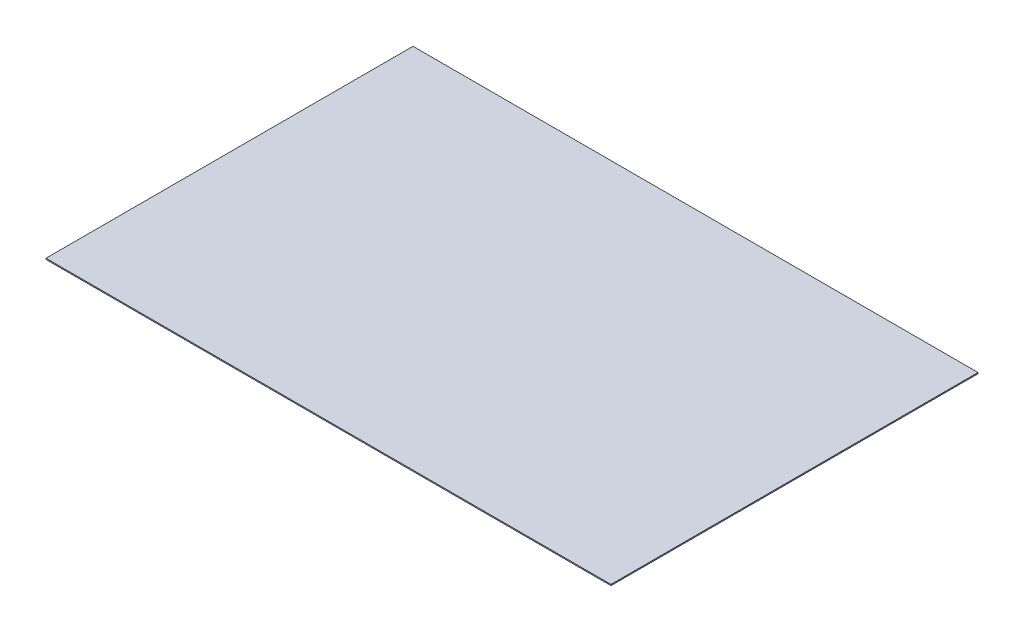
ISO-10303-21;
HEADER;
FILE_DESCRIPTION(('STEP AP214'),'2;1');
FILE_NAME('part.step','',(''),(''),'','','');
FILE_SCHEMA(('AUTOMOTIVE_DESIGN { 1 0 10303 214 1 1 1 1 }'));
ENDSEC;
DATA;
#1=APPLICATION_CONTEXT('core data for automotive mechanical design processes');
#2=APPLICATION_PROTOCOL_DEFINITION('international standard','automotive_design',2000,#1);
#3=PRODUCT_CONTEXT('',#1,'mechanical');
#4=PRODUCT('Part','Part','',(#3));
#5=PRODUCT_RELATED_PRODUCT_CATEGORY('part','',(#4));
#6=PRODUCT_DEFINITION_FORMATION('','',#4);
#7=PRODUCT_DEFINITION_CONTEXT('part definition',#1,'design');
#8=PRODUCT_DEFINITION('design','',#6,#7);
#9=PRODUCT_DEFINITION_SHAPE('','',#8);
#10=(LENGTH_UNIT() NAMED_UNIT(*) SI_UNIT(.MILLI.,.METRE.));
#11=(NAMED_UNIT(*) PLANE_ANGLE_UNIT() SI_UNIT($,.RADIAN.));
#12=(NAMED_UNIT(*) SI_UNIT($,.STERADIAN.) SOLID_ANGLE_UNIT());
#13=UNCERTAINTY_MEASURE_WITH_UNIT(LENGTH_MEASURE(1.E-05),#10,'distance_accuracy_value','');
#14=(GEOMETRIC_REPRESENTATION_CONTEXT(3) GLOBAL_UNCERTAINTY_ASSIGNED_CONTEXT((#13)) GLOBAL_UNIT_ASSIGNED_CONTEXT((#10,
#11,#12)) REPRESENTATION_CONTEXT('',''));
#15=CARTESIAN_POINT('',(0.,0.,0.));
#16=DIRECTION('',(0.,0.,1.));
#17=DIRECTION('',(1.,0.,0.));
#18=AXIS2_PLACEMENT_3D('',#15,#16,#17);
#19=CARTESIAN_POINT('',(0.,1.5875,0.));
#20=DIRECTION('',(1.,0.,0.));
#21=DIRECTION('',(0.,0.,-1.));
#22=AXIS2_PLACEMENT_3D('',#19,#20,#21);
#23=PLANE('',#22);
#24=DIRECTION('',(0.,0.,1.));
#25=VECTOR('',#24,1.);
#26=CARTESIAN_POINT('',(0.,0.,0.));
#27=LINE('',#26,#25);
#28=CARTESIAN_POINT('',(0.,0.,-526.034));
#29=VERTEX_POINT('',#28);
#30=CARTESIAN_POINT('',(0.,0.,0.));
#31=VERTEX_POINT('',#30);
#32=EDGE_CURVE('E96',#29,#31,#27,.T.);
#33=ORIENTED_EDGE('',*,*,#32,.T.);
#34=DIRECTION('',(0.,-1.,0.));
#35=VECTOR('',#34,1.);
#36=CARTESIAN_POINT('',(0.,1.5875,0.));
#37=LINE('',#36,#35);
#38=CARTESIAN_POINT('',(0.,1.5875,0.));
#39=VERTEX_POINT('',#38);
#40=EDGE_CURVE('E11',#39,#31,#37,.T.);
#41=ORIENTED_EDGE('',*,*,#40,.F.);
#42=DIRECTION('',(0.,0.,1.));
#43=VECTOR('',#42,1.);
#44=CARTESIAN_POINT('',(0.,1.5875,0.));
#45=LINE('',#44,#43);
#46=CARTESIAN_POINT('',(0.,1.5875,-526.034));
#47=VERTEX_POINT('',#46);
#48=EDGE_CURVE('E84',#47,#39,#45,.T.);
#49=ORIENTED_EDGE('',*,*,#48,.F.);
#50=DIRECTION('',(0.,-1.,0.));
#51=VECTOR('',#50,1.);
#52=CARTESIAN_POINT('',(0.,1.5875,-526.034));
#53=LINE('',#52,#51);
#54=EDGE_CURVE('E92',#47,#29,#53,.T.);
#55=ORIENTED_EDGE('',*,*,#54,.T.);
#56=EDGE_LOOP('',(#33,#41,#49,#55));
#57=FACE_BOUND('',#56,.T.);
#58=ADVANCED_FACE('F33',(#57),#23,.F.);
#59=CARTESIAN_POINT('',(0.,1.5875,0.));
#60=DIRECTION('',(0.,0.,-1.));
#61=DIRECTION('',(-1.,0.,0.));
#62=AXIS2_PLACEMENT_3D('',#59,#60,#61);
#63=PLANE('',#62);
#64=DIRECTION('',(1.,0.,0.));
#65=VECTOR('',#64,1.);
#66=CARTESIAN_POINT('',(0.,0.,0.));
#67=LINE('',#66,#65);
#68=CARTESIAN_POINT('',(809.752,0.,0.));
#69=VERTEX_POINT('',#68);
#70=EDGE_CURVE('E88',#31,#69,#67,.T.);
#71=ORIENTED_EDGE('',*,*,#70,.T.);
#72=DIRECTION('',(0.,-1.,0.));
#73=VECTOR('',#72,1.);
#74=CARTESIAN_POINT('',(809.752,1.5875,0.));
#75=LINE('',#74,#73);
#76=CARTESIAN_POINT('',(809.752,1.5875,0.));
#77=VERTEX_POINT('',#76);
#78=EDGE_CURVE('E41',#77,#69,#75,.T.);
#79=ORIENTED_EDGE('',*,*,#78,.F.);
#80=DIRECTION('',(1.,0.,0.));
#81=VECTOR('',#80,1.);
#82=CARTESIAN_POINT('',(0.,1.5875,0.));
#83=LINE('',#82,#81);
#84=EDGE_CURVE('E79',#39,#77,#83,.T.);
#85=ORIENTED_EDGE('',*,*,#84,.F.);
#86=ORIENTED_EDGE('',*,*,#40,.T.);
#87=EDGE_LOOP('',(#71,#79,#85,#86));
#88=FACE_BOUND('',#87,.T.);
#89=ADVANCED_FACE('F87',(#88),#63,.F.);
#90=CARTESIAN_POINT('',(809.752,1.5875,0.));
#91=DIRECTION('',(-1.,0.,0.));
#92=DIRECTION('',(0.,0.,1.));
#93=AXIS2_PLACEMENT_3D('',#90,#91,#92);
#94=PLANE('',#93);
#95=DIRECTION('',(0.,0.,-1.));
#96=VECTOR('',#95,1.);
#97=CARTESIAN_POINT('',(809.752,0.,0.));
#98=LINE('',#97,#96);
#99=CARTESIAN_POINT('',(809.752,0.,-526.034));
#100=VERTEX_POINT('',#99);
#101=EDGE_CURVE('E66',#69,#100,#98,.T.);
#102=ORIENTED_EDGE('',*,*,#101,.T.);
#103=DIRECTION('',(0.,-1.,0.));
#104=VECTOR('',#103,1.);
#105=CARTESIAN_POINT('',(809.752,1.5875,-526.034));
#106=LINE('',#105,#104);
#107=CARTESIAN_POINT('',(809.752,1.5875,-526.034));
#108=VERTEX_POINT('',#107);
#109=EDGE_CURVE('E89',#108,#100,#106,.T.);
#110=ORIENTED_EDGE('',*,*,#109,.F.);
#111=DIRECTION('',(0.,0.,-1.));
#112=VECTOR('',#111,1.);
#113=CARTESIAN_POINT('',(809.752,1.5875,0.));
#114=LINE('',#113,#112);
#115=EDGE_CURVE('E82',#77,#108,#114,.T.);
#116=ORIENTED_EDGE('',*,*,#115,.F.);
#117=ORIENTED_EDGE('',*,*,#78,.T.);
#118=EDGE_LOOP('',(#102,#110,#116,#117));
#119=FACE_BOUND('',#118,.T.);
#120=ADVANCED_FACE('F90',(#119),#94,.F.);
#121=CARTESIAN_POINT('',(0.,1.5875,-526.034));
#122=DIRECTION('',(0.,0.,1.));
#123=DIRECTION('',(1.,0.,0.));
#124=AXIS2_PLACEMENT_3D('',#121,#122,#123);
#125=PLANE('',#124);
#126=DIRECTION('',(-1.,0.,0.));
#127=VECTOR('',#126,1.);
#128=CARTESIAN_POINT('',(0.,0.,-526.034));
#129=LINE('',#128,#127);
#130=EDGE_CURVE('E72',#100,#29,#129,.T.);
#131=ORIENTED_EDGE('',*,*,#130,.T.);
#132=ORIENTED_EDGE('',*,*,#54,.F.);
#133=DIRECTION('',(-1.,0.,0.));
#134=VECTOR('',#133,1.);
#135=CARTESIAN_POINT('',(0.,1.5875,-526.034));
#136=LINE('',#135,#134);
#137=EDGE_CURVE('E49',#108,#47,#136,.T.);
#138=ORIENTED_EDGE('',*,*,#137,.F.);
#139=ORIENTED_EDGE('',*,*,#109,.T.);
#140=EDGE_LOOP('',(#131,#132,#138,#139));
#141=FACE_BOUND('',#140,.T.);
#142=ADVANCED_FACE('F103',(#141),#125,.F.);
#143=CARTESIAN_POINT('',(0.,1.5875,0.));
#144=DIRECTION('',(0.,-1.,0.));
#145=DIRECTION('',(0.,0.,-1.));
#146=AXIS2_PLACEMENT_3D('',#143,#144,#145);
#147=PLANE('',#146);
#148=ORIENTED_EDGE('',*,*,#48,.T.);
#149=ORIENTED_EDGE('',*,*,#84,.T.);
#150=ORIENTED_EDGE('',*,*,#115,.T.);
#151=ORIENTED_EDGE('',*,*,#137,.T.);
#152=EDGE_LOOP('',(#148,#149,#150,#151));
#153=FACE_BOUND('',#152,.T.);
#154=ADVANCED_FACE('F80',(#153),#147,.F.);
#155=CARTESIAN_POINT('',(0.,0.,0.));
#156=DIRECTION('',(0.,-1.,0.));
#157=DIRECTION('',(0.,0.,-1.));
#158=AXIS2_PLACEMENT_3D('',#155,#156,#157);
#159=PLANE('',#158);
#160=ORIENTED_EDGE('',*,*,#32,.F.);
#161=ORIENTED_EDGE('',*,*,#130,.F.);
#162=ORIENTED_EDGE('',*,*,#101,.F.);
#163=ORIENTED_EDGE('',*,*,#70,.F.);
#164=EDGE_LOOP('',(#160,#161,#162,#163));
#165=FACE_BOUND('',#164,.T.);
#166=ADVANCED_FACE('F106',(#165),#159,.T.);
#167=CLOSED_SHELL('',(#58,#89,#120,#142,#154,#166));
#168=MANIFOLD_SOLID_BREP('B2',#167);
#169=ADVANCED_BREP_SHAPE_REPRESENTATION('',(#18,#168),#14);
#170=SHAPE_DEFINITION_REPRESENTATION(#9,#169);
ENDSEC;
END-ISO-10303-21;
